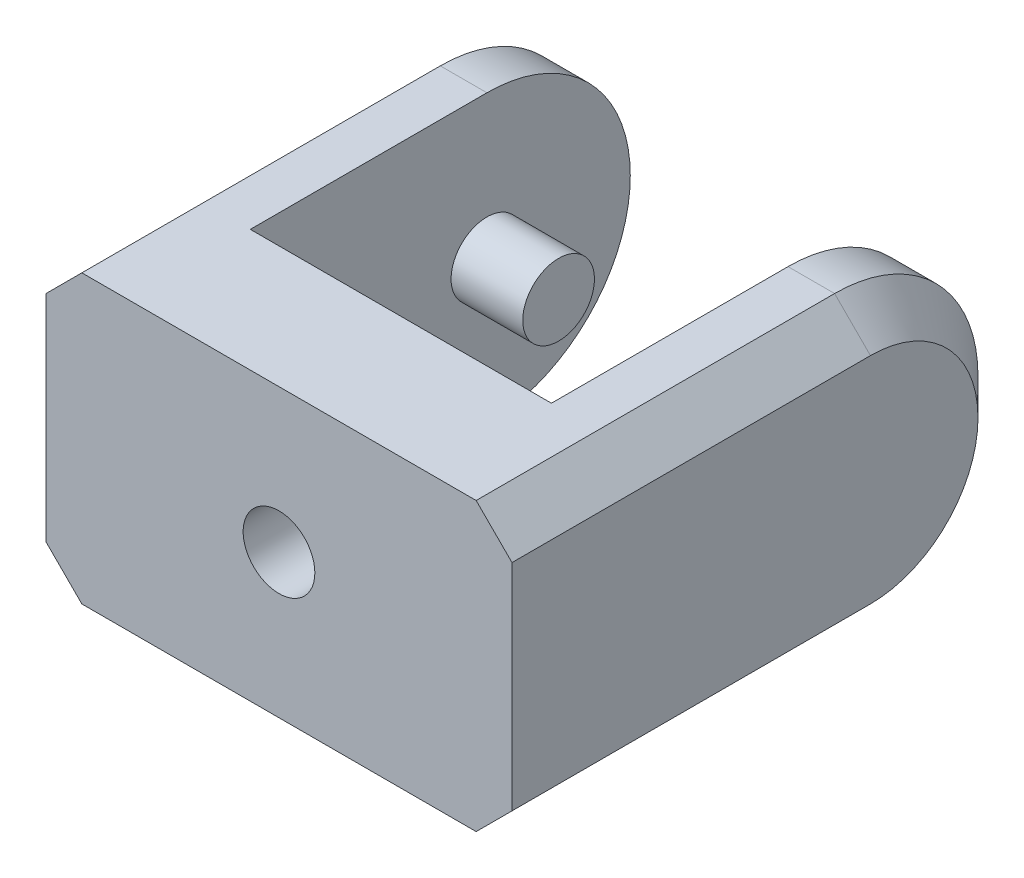
ISO-10303-21;
HEADER;
FILE_DESCRIPTION(('STEP AP214'),'2;1');
FILE_NAME('part.step','',(''),(''),'','','');
FILE_SCHEMA(('AUTOMOTIVE_DESIGN { 1 0 10303 214 1 1 1 1 }'));
ENDSEC;
DATA;
#1=APPLICATION_CONTEXT('core data for automotive mechanical design processes');
#2=APPLICATION_PROTOCOL_DEFINITION('international standard','automotive_design',2000,#1);
#3=PRODUCT_CONTEXT('',#1,'mechanical');
#4=PRODUCT('Part','Part','',(#3));
#5=PRODUCT_RELATED_PRODUCT_CATEGORY('part','',(#4));
#6=PRODUCT_DEFINITION_FORMATION('','',#4);
#7=PRODUCT_DEFINITION_CONTEXT('part definition',#1,'design');
#8=PRODUCT_DEFINITION('design','',#6,#7);
#9=PRODUCT_DEFINITION_SHAPE('','',#8);
#10=(LENGTH_UNIT() NAMED_UNIT(*) SI_UNIT(.MILLI.,.METRE.));
#11=(NAMED_UNIT(*) PLANE_ANGLE_UNIT() SI_UNIT($,.RADIAN.));
#12=(NAMED_UNIT(*) SI_UNIT($,.STERADIAN.) SOLID_ANGLE_UNIT());
#13=UNCERTAINTY_MEASURE_WITH_UNIT(LENGTH_MEASURE(1.E-05),#10,'distance_accuracy_value','');
#14=(GEOMETRIC_REPRESENTATION_CONTEXT(3) GLOBAL_UNCERTAINTY_ASSIGNED_CONTEXT((#13)) GLOBAL_UNIT_ASSIGNED_CONTEXT((#10,
#11,#12)) REPRESENTATION_CONTEXT('',''));
#15=CARTESIAN_POINT('',(0.,0.,0.));
#16=DIRECTION('',(0.,0.,1.));
#17=DIRECTION('',(1.,0.,0.));
#18=AXIS2_PLACEMENT_3D('',#15,#16,#17);
#19=CARTESIAN_POINT('',(0.,0.,0.));
#20=DIRECTION('',(0.,0.,-1.));
#21=DIRECTION('',(-1.,0.,0.));
#22=AXIS2_PLACEMENT_3D('',#19,#20,#21);
#23=PLANE('',#22);
#24=DIRECTION('',(1.,0.,0.));
#25=VECTOR('',#24,1.);
#26=CARTESIAN_POINT('',(0.,40.,0.));
#27=LINE('',#26,#25);
#28=CARTESIAN_POINT('',(11.5,40.,0.));
#29=VERTEX_POINT('',#28);
#30=CARTESIAN_POINT('',(53.5,40.,0.));
#31=VERTEX_POINT('',#30);
#32=EDGE_CURVE('E170',#29,#31,#27,.T.);
#33=ORIENTED_EDGE('',*,*,#32,.T.);
#34=DIRECTION('',(0.,1.,0.));
#35=VECTOR('',#34,1.);
#36=CARTESIAN_POINT('',(53.5,40.,0.));
#37=LINE('',#36,#35);
#38=CARTESIAN_POINT('',(53.5,0.,0.));
#39=VERTEX_POINT('',#38);
#40=EDGE_CURVE('E168',#39,#31,#37,.T.);
#41=ORIENTED_EDGE('',*,*,#40,.F.);
#42=DIRECTION('',(1.,0.,0.));
#43=VECTOR('',#42,1.);
#44=CARTESIAN_POINT('',(0.,0.,0.));
#45=LINE('',#44,#43);
#46=CARTESIAN_POINT('',(11.5,0.,0.));
#47=VERTEX_POINT('',#46);
#48=EDGE_CURVE('E153',#47,#39,#45,.T.);
#49=ORIENTED_EDGE('',*,*,#48,.F.);
#50=DIRECTION('',(0.,-1.,0.));
#51=VECTOR('',#50,1.);
#52=CARTESIAN_POINT('',(11.5,40.,0.));
#53=LINE('',#52,#51);
#54=EDGE_CURVE('E160',#29,#47,#53,.T.);
#55=ORIENTED_EDGE('',*,*,#54,.F.);
#56=EDGE_LOOP('',(#33,#41,#49,#55));
#57=FACE_BOUND('',#56,.T.);
#58=ADVANCED_FACE('F39',(#57),#23,.T.);
#59=CARTESIAN_POINT('',(0.,0.,17.));
#60=DIRECTION('',(-1.,0.,0.));
#61=DIRECTION('',(0.,-1.,0.));
#62=AXIS2_PLACEMENT_3D('',#59,#60,#61);
#63=PLANE('',#62);
#64=DIRECTION('',(0.,1.,0.));
#65=VECTOR('',#64,1.);
#66=CARTESIAN_POINT('',(0.,0.,17.));
#67=LINE('',#66,#65);
#68=CARTESIAN_POINT('',(0.,5.00000000000002,17.));
#69=VERTEX_POINT('',#68);
#70=CARTESIAN_POINT('',(0.,35.,17.));
#71=VERTEX_POINT('',#70);
#72=EDGE_CURVE('E169',#69,#71,#67,.T.);
#73=ORIENTED_EDGE('',*,*,#72,.T.);
#74=DIRECTION('',(0.,0.,-1.));
#75=VECTOR('',#74,1.);
#76=CARTESIAN_POINT('',(0.,35.,17.));
#77=LINE('',#76,#75);
#78=CARTESIAN_POINT('',(0.,35.,-33.));
#79=VERTEX_POINT('',#78);
#80=EDGE_CURVE('E223',#71,#79,#77,.T.);
#81=ORIENTED_EDGE('',*,*,#80,.T.);
#82=CARTESIAN_POINT('',(0.,20.,-33.));
#83=DIRECTION('',(-1.,0.,0.));
#84=DIRECTION('',(0.,-1.,0.));
#85=AXIS2_PLACEMENT_3D('',#82,#83,#84);
#86=CIRCLE('',#85,15.);
#87=CARTESIAN_POINT('',(0.,20.,-48.));
#88=VERTEX_POINT('',#87);
#89=EDGE_CURVE('E221',#79,#88,#86,.T.);
#90=ORIENTED_EDGE('',*,*,#89,.T.);
#91=CARTESIAN_POINT('',(0.,20.,-33.));
#92=DIRECTION('',(-1.,0.,0.));
#93=DIRECTION('',(0.,-1.,0.));
#94=AXIS2_PLACEMENT_3D('',#91,#92,#93);
#95=CIRCLE('',#94,15.);
#96=CARTESIAN_POINT('',(0.,5.00000000000002,-33.));
#97=VERTEX_POINT('',#96);
#98=EDGE_CURVE('E219',#88,#97,#95,.T.);
#99=ORIENTED_EDGE('',*,*,#98,.T.);
#100=DIRECTION('',(0.,0.,1.));
#101=VECTOR('',#100,1.);
#102=CARTESIAN_POINT('',(0.,5.00000000000002,17.));
#103=LINE('',#102,#101);
#104=EDGE_CURVE('E210',#97,#69,#103,.T.);
#105=ORIENTED_EDGE('',*,*,#104,.T.);
#106=EDGE_LOOP('',(#73,#81,#90,#99,#105));
#107=FACE_BOUND('',#106,.T.);
#108=ADVANCED_FACE('F355',(#107),#63,.T.);
#109=CARTESIAN_POINT('',(0.,0.,17.));
#110=DIRECTION('',(0.,1.,0.));
#111=DIRECTION('',(0.,0.,1.));
#112=AXIS2_PLACEMENT_3D('',#109,#110,#111);
#113=PLANE('',#112);
#114=DIRECTION('',(1.,0.,0.));
#115=VECTOR('',#114,1.);
#116=CARTESIAN_POINT('',(0.,0.,17.));
#117=LINE('',#116,#115);
#118=CARTESIAN_POINT('',(5.,0.,17.));
#119=VERTEX_POINT('',#118);
#120=CARTESIAN_POINT('',(60.,0.,17.));
#121=VERTEX_POINT('',#120);
#122=EDGE_CURVE('E188',#119,#121,#117,.T.);
#123=ORIENTED_EDGE('',*,*,#122,.F.);
#124=DIRECTION('',(0.,0.,-1.));
#125=VECTOR('',#124,1.);
#126=CARTESIAN_POINT('',(5.,0.,-33.));
#127=LINE('',#126,#125);
#128=CARTESIAN_POINT('',(5.,0.,-33.));
#129=VERTEX_POINT('',#128);
#130=EDGE_CURVE('E245',#119,#129,#127,.T.);
#131=ORIENTED_EDGE('',*,*,#130,.T.);
#132=DIRECTION('',(-1.,0.,0.));
#133=VECTOR('',#132,1.);
#134=CARTESIAN_POINT('',(0.,0.,-33.));
#135=LINE('',#134,#133);
#136=CARTESIAN_POINT('',(11.5,0.,-33.));
#137=VERTEX_POINT('',#136);
#138=EDGE_CURVE('E155',#129,#137,#135,.F.);
#139=ORIENTED_EDGE('',*,*,#138,.T.);
#140=DIRECTION('',(0.,0.,1.));
#141=VECTOR('',#140,1.);
#142=CARTESIAN_POINT('',(11.5,0.,-53.));
#143=LINE('',#142,#141);
#144=EDGE_CURVE('E148',#137,#47,#143,.T.);
#145=ORIENTED_EDGE('',*,*,#144,.T.);
#146=ORIENTED_EDGE('',*,*,#48,.T.);
#147=DIRECTION('',(0.,0.,1.));
#148=VECTOR('',#147,1.);
#149=CARTESIAN_POINT('',(53.5,0.,-53.));
#150=LINE('',#149,#148);
#151=CARTESIAN_POINT('',(53.5,0.,-33.));
#152=VERTEX_POINT('',#151);
#153=EDGE_CURVE('E213',#152,#39,#150,.T.);
#154=ORIENTED_EDGE('',*,*,#153,.F.);
#155=DIRECTION('',(-1.,0.,0.));
#156=VECTOR('',#155,1.);
#157=CARTESIAN_POINT('',(65.,0.,-33.));
#158=LINE('',#157,#156);
#159=CARTESIAN_POINT('',(60.,0.,-33.));
#160=VERTEX_POINT('',#159);
#161=EDGE_CURVE('E207',#152,#160,#158,.F.);
#162=ORIENTED_EDGE('',*,*,#161,.T.);
#163=DIRECTION('',(0.,0.,1.));
#164=VECTOR('',#163,1.);
#165=CARTESIAN_POINT('',(60.,0.,17.));
#166=LINE('',#165,#164);
#167=EDGE_CURVE('E243',#160,#121,#166,.T.);
#168=ORIENTED_EDGE('',*,*,#167,.T.);
#169=EDGE_LOOP('',(#123,#131,#139,#145,#146,#154,#162,#168));
#170=FACE_BOUND('',#169,.T.);
#171=ADVANCED_FACE('F151',(#170),#113,.F.);
#172=CARTESIAN_POINT('',(65.,0.,17.));
#173=DIRECTION('',(-1.,0.,0.));
#174=DIRECTION('',(0.,-1.,0.));
#175=AXIS2_PLACEMENT_3D('',#172,#173,#174);
#176=PLANE('',#175);
#177=CARTESIAN_POINT('',(65.,20.,-33.));
#178=DIRECTION('',(-1.,0.,0.));
#179=DIRECTION('',(0.,-1.,0.));
#180=AXIS2_PLACEMENT_3D('',#177,#178,#179);
#181=CIRCLE('',#180,15.);
#182=CARTESIAN_POINT('',(65.,20.,-48.));
#183=VERTEX_POINT('',#182);
#184=CARTESIAN_POINT('',(65.,35.,-33.));
#185=VERTEX_POINT('',#184);
#186=EDGE_CURVE('E63',#183,#185,#181,.F.);
#187=ORIENTED_EDGE('',*,*,#186,.T.);
#188=DIRECTION('',(0.,0.,1.));
#189=VECTOR('',#188,1.);
#190=CARTESIAN_POINT('',(65.,35.,17.));
#191=LINE('',#190,#189);
#192=CARTESIAN_POINT('',(65.,35.,17.));
#193=VERTEX_POINT('',#192);
#194=EDGE_CURVE('E252',#185,#193,#191,.T.);
#195=ORIENTED_EDGE('',*,*,#194,.T.);
#196=DIRECTION('',(0.,1.,0.));
#197=VECTOR('',#196,1.);
#198=CARTESIAN_POINT('',(65.,0.,17.));
#199=LINE('',#198,#197);
#200=CARTESIAN_POINT('',(65.,4.99999999999999,17.));
#201=VERTEX_POINT('',#200);
#202=EDGE_CURVE('E185',#201,#193,#199,.T.);
#203=ORIENTED_EDGE('',*,*,#202,.F.);
#204=DIRECTION('',(0.,0.,-1.));
#205=VECTOR('',#204,1.);
#206=CARTESIAN_POINT('',(65.,4.99999999999999,17.));
#207=LINE('',#206,#205);
#208=CARTESIAN_POINT('',(65.,4.99999999999999,-33.));
#209=VERTEX_POINT('',#208);
#210=EDGE_CURVE('E247',#201,#209,#207,.T.);
#211=ORIENTED_EDGE('',*,*,#210,.T.);
#212=CARTESIAN_POINT('',(65.,20.,-33.));
#213=DIRECTION('',(-1.,0.,0.));
#214=DIRECTION('',(0.,-1.,0.));
#215=AXIS2_PLACEMENT_3D('',#212,#213,#214);
#216=CIRCLE('',#215,15.);
#217=EDGE_CURVE('E249',#209,#183,#216,.F.);
#218=ORIENTED_EDGE('',*,*,#217,.T.);
#219=EDGE_LOOP('',(#187,#195,#203,#211,#218));
#220=FACE_BOUND('',#219,.T.);
#221=ADVANCED_FACE('F365',(#220),#176,.F.);
#222=CARTESIAN_POINT('',(0.,40.,17.));
#223=DIRECTION('',(0.,1.,0.));
#224=DIRECTION('',(0.,0.,1.));
#225=AXIS2_PLACEMENT_3D('',#222,#223,#224);
#226=PLANE('',#225);
#227=DIRECTION('',(1.,0.,0.));
#228=VECTOR('',#227,1.);
#229=CARTESIAN_POINT('',(0.,40.,-33.));
#230=LINE('',#229,#228);
#231=CARTESIAN_POINT('',(11.5,40.,-33.));
#232=VERTEX_POINT('',#231);
#233=CARTESIAN_POINT('',(5.,40.,-33.));
#234=VERTEX_POINT('',#233);
#235=EDGE_CURVE('E191',#232,#234,#230,.F.);
#236=ORIENTED_EDGE('',*,*,#235,.T.);
#237=DIRECTION('',(0.,0.,1.));
#238=VECTOR('',#237,1.);
#239=CARTESIAN_POINT('',(4.99999999999999,40.,17.));
#240=LINE('',#239,#238);
#241=CARTESIAN_POINT('',(4.99999999999999,40.,17.));
#242=VERTEX_POINT('',#241);
#243=EDGE_CURVE('E229',#234,#242,#240,.T.);
#244=ORIENTED_EDGE('',*,*,#243,.T.);
#245=DIRECTION('',(1.,0.,0.));
#246=VECTOR('',#245,1.);
#247=CARTESIAN_POINT('',(0.,40.,17.));
#248=LINE('',#247,#246);
#249=CARTESIAN_POINT('',(60.,40.,17.));
#250=VERTEX_POINT('',#249);
#251=EDGE_CURVE('E182',#242,#250,#248,.T.);
#252=ORIENTED_EDGE('',*,*,#251,.T.);
#253=DIRECTION('',(0.,0.,-1.));
#254=VECTOR('',#253,1.);
#255=CARTESIAN_POINT('',(60.,40.,-33.));
#256=LINE('',#255,#254);
#257=CARTESIAN_POINT('',(60.,40.,-33.));
#258=VERTEX_POINT('',#257);
#259=EDGE_CURVE('E226',#250,#258,#256,.T.);
#260=ORIENTED_EDGE('',*,*,#259,.T.);
#261=DIRECTION('',(1.,0.,0.));
#262=VECTOR('',#261,1.);
#263=CARTESIAN_POINT('',(0.,40.,-33.));
#264=LINE('',#263,#262);
#265=CARTESIAN_POINT('',(53.5,40.,-33.));
#266=VERTEX_POINT('',#265);
#267=EDGE_CURVE('E195',#258,#266,#264,.F.);
#268=ORIENTED_EDGE('',*,*,#267,.T.);
#269=DIRECTION('',(0.,0.,1.));
#270=VECTOR('',#269,1.);
#271=CARTESIAN_POINT('',(53.5,40.,-53.));
#272=LINE('',#271,#270);
#273=EDGE_CURVE('E175',#266,#31,#272,.T.);
#274=ORIENTED_EDGE('',*,*,#273,.T.);
#275=ORIENTED_EDGE('',*,*,#32,.F.);
#276=DIRECTION('',(0.,0.,1.));
#277=VECTOR('',#276,1.);
#278=CARTESIAN_POINT('',(11.5,40.,-53.));
#279=LINE('',#278,#277);
#280=EDGE_CURVE('E159',#232,#29,#279,.T.);
#281=ORIENTED_EDGE('',*,*,#280,.F.);
#282=EDGE_LOOP('',(#236,#244,#252,#260,#268,#274,#275,#281));
#283=FACE_BOUND('',#282,.T.);
#284=ADVANCED_FACE('F300',(#283),#226,.T.);
#285=CARTESIAN_POINT('',(0.,0.,17.));
#286=DIRECTION('',(0.,0.,-1.));
#287=DIRECTION('',(-1.,0.,0.));
#288=AXIS2_PLACEMENT_3D('',#285,#286,#287);
#289=PLANE('',#288);
#290=CARTESIAN_POINT('',(32.5,20.,17.));
#291=DIRECTION('',(0.,0.,1.));
#292=DIRECTION('',(1.,0.,0.));
#293=AXIS2_PLACEMENT_3D('',#290,#291,#292);
#294=CIRCLE('',#293,5.);
#295=CARTESIAN_POINT('',(37.5,20.,17.));
#296=VERTEX_POINT('',#295);
#297=EDGE_CURVE('E326',#296,#296,#294,.T.);
#298=ORIENTED_EDGE('',*,*,#297,.F.);
#299=EDGE_LOOP('',(#298));
#300=FACE_BOUND('',#299,.T.);
#301=ORIENTED_EDGE('',*,*,#251,.F.);
#302=DIRECTION('',(0.707106781186547,0.707106781186549,0.));
#303=VECTOR('',#302,1.);
#304=CARTESIAN_POINT('',(0.,35.,17.));
#305=LINE('',#304,#303);
#306=EDGE_CURVE('E237',#242,#71,#305,.F.);
#307=ORIENTED_EDGE('',*,*,#306,.T.);
#308=ORIENTED_EDGE('',*,*,#72,.F.);
#309=DIRECTION('',(0.707106781186547,-0.707106781186549,0.));
#310=VECTOR('',#309,1.);
#311=CARTESIAN_POINT('',(5.,0.,17.));
#312=LINE('',#311,#310);
#313=EDGE_CURVE('E235',#69,#119,#312,.T.);
#314=ORIENTED_EDGE('',*,*,#313,.T.);
#315=ORIENTED_EDGE('',*,*,#122,.T.);
#316=DIRECTION('',(-0.707106781186549,-0.707106781186546,0.));
#317=VECTOR('',#316,1.);
#318=CARTESIAN_POINT('',(65.,4.99999999999999,17.));
#319=LINE('',#318,#317);
#320=EDGE_CURVE('E231',#121,#201,#319,.F.);
#321=ORIENTED_EDGE('',*,*,#320,.T.);
#322=ORIENTED_EDGE('',*,*,#202,.T.);
#323=DIRECTION('',(-0.707106781186549,0.707106781186546,0.));
#324=VECTOR('',#323,1.);
#325=CARTESIAN_POINT('',(60.,40.,17.));
#326=LINE('',#325,#324);
#327=EDGE_CURVE('E233',#193,#250,#326,.T.);
#328=ORIENTED_EDGE('',*,*,#327,.T.);
#329=EDGE_LOOP('',(#301,#307,#308,#314,#315,#321,#322,#328));
#330=FACE_BOUND('',#329,.T.);
#331=ADVANCED_FACE('F284',(#300,#330),#289,.F.);
#332=CARTESIAN_POINT('',(11.5,40.,-53.));
#333=DIRECTION('',(-1.,0.,0.));
#334=DIRECTION('',(0.,-1.,0.));
#335=AXIS2_PLACEMENT_3D('',#332,#333,#334);
#336=PLANE('',#335);
#337=CARTESIAN_POINT('',(11.5,20.,-33.));
#338=DIRECTION('',(-1.,0.,0.));
#339=DIRECTION('',(0.,-1.,0.));
#340=AXIS2_PLACEMENT_3D('',#337,#338,#339);
#341=CIRCLE('',#340,5.);
#342=CARTESIAN_POINT('',(11.5,15.,-33.));
#343=VERTEX_POINT('',#342);
#344=EDGE_CURVE('E11',#343,#343,#341,.F.);
#345=ORIENTED_EDGE('',*,*,#344,.F.);
#346=EDGE_LOOP('',(#345));
#347=FACE_BOUND('',#346,.T.);
#348=CARTESIAN_POINT('',(11.5,20.,-33.));
#349=DIRECTION('',(-1.,0.,0.));
#350=DIRECTION('',(0.,-1.,0.));
#351=AXIS2_PLACEMENT_3D('',#348,#349,#350);
#352=CIRCLE('',#351,20.);
#353=CARTESIAN_POINT('',(11.5,20.,-53.));
#354=VERTEX_POINT('',#353);
#355=EDGE_CURVE('E202',#137,#354,#352,.F.);
#356=ORIENTED_EDGE('',*,*,#355,.T.);
#357=CARTESIAN_POINT('',(11.5,20.,-33.));
#358=DIRECTION('',(-1.,0.,0.));
#359=DIRECTION('',(0.,-1.,0.));
#360=AXIS2_PLACEMENT_3D('',#357,#358,#359);
#361=CIRCLE('',#360,20.);
#362=EDGE_CURVE('E204',#354,#232,#361,.F.);
#363=ORIENTED_EDGE('',*,*,#362,.T.);
#364=ORIENTED_EDGE('',*,*,#280,.T.);
#365=ORIENTED_EDGE('',*,*,#54,.T.);
#366=ORIENTED_EDGE('',*,*,#144,.F.);
#367=EDGE_LOOP('',(#356,#363,#364,#365,#366));
#368=FACE_BOUND('',#367,.T.);
#369=ADVANCED_FACE('F172',(#347,#368),#336,.F.);
#370=CARTESIAN_POINT('',(53.5,40.,-53.));
#371=DIRECTION('',(1.,0.,0.));
#372=DIRECTION('',(0.,1.,0.));
#373=AXIS2_PLACEMENT_3D('',#370,#371,#372);
#374=PLANE('',#373);
#375=ORIENTED_EDGE('',*,*,#273,.F.);
#376=CARTESIAN_POINT('',(53.5,20.,-33.));
#377=DIRECTION('',(1.,0.,0.));
#378=DIRECTION('',(0.,1.,0.));
#379=AXIS2_PLACEMENT_3D('',#376,#377,#378);
#380=CIRCLE('',#379,20.);
#381=CARTESIAN_POINT('',(53.5,20.,-53.));
#382=VERTEX_POINT('',#381);
#383=EDGE_CURVE('E199',#266,#382,#380,.F.);
#384=ORIENTED_EDGE('',*,*,#383,.T.);
#385=CARTESIAN_POINT('',(53.5,20.,-33.));
#386=DIRECTION('',(1.,0.,0.));
#387=DIRECTION('',(0.,1.,0.));
#388=AXIS2_PLACEMENT_3D('',#385,#386,#387);
#389=CIRCLE('',#388,20.);
#390=EDGE_CURVE('E197',#382,#152,#389,.F.);
#391=ORIENTED_EDGE('',*,*,#390,.T.);
#392=ORIENTED_EDGE('',*,*,#153,.T.);
#393=ORIENTED_EDGE('',*,*,#40,.T.);
#394=EDGE_LOOP('',(#375,#384,#391,#392,#393));
#395=FACE_BOUND('',#394,.T.);
#396=ADVANCED_FACE('F323',(#395),#374,.F.);
#397=CARTESIAN_POINT('',(0.,20.,-33.));
#398=DIRECTION('',(1.,0.,0.));
#399=DIRECTION('',(0.,0.,-1.));
#400=AXIS2_PLACEMENT_3D('',#397,#398,#399);
#401=CYLINDRICAL_SURFACE('',#400,20.);
#402=DIRECTION('',(-1.,0.,0.));
#403=VECTOR('',#402,1.);
#404=CARTESIAN_POINT('',(53.5,20.,-53.));
#405=LINE('',#404,#403);
#406=CARTESIAN_POINT('',(60.,20.,-53.));
#407=VERTEX_POINT('',#406);
#408=EDGE_CURVE('E211',#407,#382,#405,.T.);
#409=ORIENTED_EDGE('',*,*,#408,.F.);
#410=CARTESIAN_POINT('',(60.,20.,-33.));
#411=DIRECTION('',(-1.,0.,0.));
#412=DIRECTION('',(0.,0.,1.));
#413=AXIS2_PLACEMENT_3D('',#410,#411,#412);
#414=CIRCLE('',#413,20.);
#415=EDGE_CURVE('E48',#407,#160,#414,.T.);
#416=ORIENTED_EDGE('',*,*,#415,.T.);
#417=ORIENTED_EDGE('',*,*,#161,.F.);
#418=ORIENTED_EDGE('',*,*,#390,.F.);
#419=EDGE_LOOP('',(#409,#416,#417,#418));
#420=FACE_BOUND('',#419,.T.);
#421=ADVANCED_FACE('F350',(#420),#401,.T.);
#422=CARTESIAN_POINT('',(0.,20.,-33.));
#423=DIRECTION('',(1.,0.,0.));
#424=DIRECTION('',(0.,0.,-1.));
#425=AXIS2_PLACEMENT_3D('',#422,#423,#424);
#426=CYLINDRICAL_SURFACE('',#425,20.);
#427=ORIENTED_EDGE('',*,*,#267,.F.);
#428=CARTESIAN_POINT('',(60.,20.,-33.));
#429=DIRECTION('',(-1.,0.,0.));
#430=DIRECTION('',(0.,0.,1.));
#431=AXIS2_PLACEMENT_3D('',#428,#429,#430);
#432=CIRCLE('',#431,20.);
#433=EDGE_CURVE('E55',#258,#407,#432,.T.);
#434=ORIENTED_EDGE('',*,*,#433,.T.);
#435=ORIENTED_EDGE('',*,*,#408,.T.);
#436=ORIENTED_EDGE('',*,*,#383,.F.);
#437=EDGE_LOOP('',(#427,#434,#435,#436));
#438=FACE_BOUND('',#437,.T.);
#439=ADVANCED_FACE('F319',(#438),#426,.T.);
#440=CARTESIAN_POINT('',(0.,20.,-33.));
#441=DIRECTION('',(-1.,0.,0.));
#442=DIRECTION('',(0.,0.,1.));
#443=AXIS2_PLACEMENT_3D('',#440,#441,#442);
#444=CYLINDRICAL_SURFACE('',#443,20.);
#445=ORIENTED_EDGE('',*,*,#138,.F.);
#446=CARTESIAN_POINT('',(5.,20.,-33.));
#447=DIRECTION('',(-1.,0.,0.));
#448=DIRECTION('',(0.,0.,1.));
#449=AXIS2_PLACEMENT_3D('',#446,#447,#448);
#450=CIRCLE('',#449,20.);
#451=CARTESIAN_POINT('',(5.,20.,-53.));
#452=VERTEX_POINT('',#451);
#453=EDGE_CURVE('E241',#129,#452,#450,.F.);
#454=ORIENTED_EDGE('',*,*,#453,.T.);
#455=DIRECTION('',(-1.,0.,0.));
#456=VECTOR('',#455,1.);
#457=CARTESIAN_POINT('',(0.,20.,-53.));
#458=LINE('',#457,#456);
#459=EDGE_CURVE('E214',#354,#452,#458,.T.);
#460=ORIENTED_EDGE('',*,*,#459,.F.);
#461=ORIENTED_EDGE('',*,*,#355,.F.);
#462=EDGE_LOOP('',(#445,#454,#460,#461));
#463=FACE_BOUND('',#462,.T.);
#464=ADVANCED_FACE('F294',(#463),#444,.T.);
#465=CARTESIAN_POINT('',(0.,20.,-33.));
#466=DIRECTION('',(-1.,0.,0.));
#467=DIRECTION('',(0.,0.,1.));
#468=AXIS2_PLACEMENT_3D('',#465,#466,#467);
#469=CYLINDRICAL_SURFACE('',#468,20.);
#470=ORIENTED_EDGE('',*,*,#459,.T.);
#471=CARTESIAN_POINT('',(5.,20.,-33.));
#472=DIRECTION('',(-1.,0.,0.));
#473=DIRECTION('',(0.,0.,1.));
#474=AXIS2_PLACEMENT_3D('',#471,#472,#473);
#475=CIRCLE('',#474,20.);
#476=EDGE_CURVE('E239',#452,#234,#475,.F.);
#477=ORIENTED_EDGE('',*,*,#476,.T.);
#478=ORIENTED_EDGE('',*,*,#235,.F.);
#479=ORIENTED_EDGE('',*,*,#362,.F.);
#480=EDGE_LOOP('',(#470,#477,#478,#479));
#481=FACE_BOUND('',#480,.T.);
#482=ADVANCED_FACE('F302',(#481),#469,.T.);
#483=CARTESIAN_POINT('',(5.,0.,17.));
#484=DIRECTION('',(-0.707106781186549,-0.707106781186547,0.));
#485=DIRECTION('',(0.,0.,1.));
#486=AXIS2_PLACEMENT_3D('',#483,#484,#485);
#487=PLANE('',#486);
#488=ORIENTED_EDGE('',*,*,#313,.F.);
#489=ORIENTED_EDGE('',*,*,#104,.F.);
#490=DIRECTION('',(-0.707106781186547,0.707106781186549,0.));
#491=VECTOR('',#490,1.);
#492=CARTESIAN_POINT('',(5.,0.,-33.));
#493=LINE('',#492,#491);
#494=EDGE_CURVE('E217',#129,#97,#493,.T.);
#495=ORIENTED_EDGE('',*,*,#494,.F.);
#496=ORIENTED_EDGE('',*,*,#130,.F.);
#497=EDGE_LOOP('',(#488,#489,#495,#496));
#498=FACE_BOUND('',#497,.T.);
#499=ADVANCED_FACE('F290',(#498),#487,.T.);
#500=CARTESIAN_POINT('',(0.,20.,-33.));
#501=DIRECTION('',(1.,0.,0.));
#502=DIRECTION('',(0.,0.,-1.));
#503=AXIS2_PLACEMENT_3D('',#500,#501,#502);
#504=CONICAL_SURFACE('',#503,15.,0.78539816339745);
#505=ORIENTED_EDGE('',*,*,#494,.T.);
#506=ORIENTED_EDGE('',*,*,#98,.F.);
#507=DIRECTION('',(-0.707106781186547,0.,0.707106781186549));
#508=VECTOR('',#507,1.);
#509=CARTESIAN_POINT('',(5.,20.,-53.));
#510=LINE('',#509,#508);
#511=EDGE_CURVE('E258',#452,#88,#510,.T.);
#512=ORIENTED_EDGE('',*,*,#511,.F.);
#513=ORIENTED_EDGE('',*,*,#453,.F.);
#514=EDGE_LOOP('',(#505,#506,#512,#513));
#515=FACE_BOUND('',#514,.T.);
#516=ADVANCED_FACE('F390',(#515),#504,.T.);
#517=CARTESIAN_POINT('',(0.,20.,-33.));
#518=DIRECTION('',(1.,0.,0.));
#519=DIRECTION('',(0.,0.,-1.));
#520=AXIS2_PLACEMENT_3D('',#517,#518,#519);
#521=CONICAL_SURFACE('',#520,15.,0.78539816339745);
#522=ORIENTED_EDGE('',*,*,#511,.T.);
#523=ORIENTED_EDGE('',*,*,#89,.F.);
#524=DIRECTION('',(-0.707106781186547,-0.707106781186548,0.));
#525=VECTOR('',#524,1.);
#526=CARTESIAN_POINT('',(5.,40.,-33.));
#527=LINE('',#526,#525);
#528=EDGE_CURVE('E256',#234,#79,#527,.T.);
#529=ORIENTED_EDGE('',*,*,#528,.F.);
#530=ORIENTED_EDGE('',*,*,#476,.F.);
#531=EDGE_LOOP('',(#522,#523,#529,#530));
#532=FACE_BOUND('',#531,.T.);
#533=ADVANCED_FACE('F307',(#532),#521,.T.);
#534=CARTESIAN_POINT('',(0.,35.,17.));
#535=DIRECTION('',(0.707106781186549,-0.707106781186547,0.));
#536=DIRECTION('',(0.,0.,-1.));
#537=AXIS2_PLACEMENT_3D('',#534,#535,#536);
#538=PLANE('',#537);
#539=ORIENTED_EDGE('',*,*,#306,.F.);
#540=ORIENTED_EDGE('',*,*,#243,.F.);
#541=ORIENTED_EDGE('',*,*,#528,.T.);
#542=ORIENTED_EDGE('',*,*,#80,.F.);
#543=EDGE_LOOP('',(#539,#540,#541,#542));
#544=FACE_BOUND('',#543,.T.);
#545=ADVANCED_FACE('F312',(#544),#538,.F.);
#546=CARTESIAN_POINT('',(65.,4.99999999999999,17.));
#547=DIRECTION('',(-0.707106781186546,0.707106781186549,0.));
#548=DIRECTION('',(0.,0.,-1.));
#549=AXIS2_PLACEMENT_3D('',#546,#547,#548);
#550=PLANE('',#549);
#551=ORIENTED_EDGE('',*,*,#320,.F.);
#552=ORIENTED_EDGE('',*,*,#167,.F.);
#553=DIRECTION('',(-0.707106781186549,-0.707106781186546,0.));
#554=VECTOR('',#553,1.);
#555=CARTESIAN_POINT('',(65.,4.99999999999999,-33.));
#556=LINE('',#555,#554);
#557=EDGE_CURVE('E259',#209,#160,#556,.T.);
#558=ORIENTED_EDGE('',*,*,#557,.F.);
#559=ORIENTED_EDGE('',*,*,#210,.F.);
#560=EDGE_LOOP('',(#551,#552,#558,#559));
#561=FACE_BOUND('',#560,.T.);
#562=ADVANCED_FACE('F42',(#561),#550,.F.);
#563=CARTESIAN_POINT('',(65.,20.,-33.));
#564=DIRECTION('',(-1.,0.,0.));
#565=DIRECTION('',(0.,0.,1.));
#566=AXIS2_PLACEMENT_3D('',#563,#564,#565);
#567=CONICAL_SURFACE('',#566,15.,0.785398163397445);
#568=ORIENTED_EDGE('',*,*,#557,.T.);
#569=ORIENTED_EDGE('',*,*,#415,.F.);
#570=DIRECTION('',(-0.707106781186549,0.,-0.707106781186546));
#571=VECTOR('',#570,1.);
#572=CARTESIAN_POINT('',(65.,20.,-48.));
#573=LINE('',#572,#571);
#574=EDGE_CURVE('E266',#183,#407,#573,.T.);
#575=ORIENTED_EDGE('',*,*,#574,.F.);
#576=ORIENTED_EDGE('',*,*,#217,.F.);
#577=EDGE_LOOP('',(#568,#569,#575,#576));
#578=FACE_BOUND('',#577,.T.);
#579=ADVANCED_FACE('F274',(#578),#567,.T.);
#580=CARTESIAN_POINT('',(65.,20.,-33.));
#581=DIRECTION('',(-1.,0.,0.));
#582=DIRECTION('',(0.,0.,1.));
#583=AXIS2_PLACEMENT_3D('',#580,#581,#582);
#584=CONICAL_SURFACE('',#583,15.,0.785398163397446);
#585=ORIENTED_EDGE('',*,*,#574,.T.);
#586=ORIENTED_EDGE('',*,*,#433,.F.);
#587=DIRECTION('',(-0.707106781186549,0.707106781186546,0.));
#588=VECTOR('',#587,1.);
#589=CARTESIAN_POINT('',(65.,35.,-33.));
#590=LINE('',#589,#588);
#591=EDGE_CURVE('E264',#185,#258,#590,.T.);
#592=ORIENTED_EDGE('',*,*,#591,.F.);
#593=ORIENTED_EDGE('',*,*,#186,.F.);
#594=EDGE_LOOP('',(#585,#586,#592,#593));
#595=FACE_BOUND('',#594,.T.);
#596=ADVANCED_FACE('F408',(#595),#584,.T.);
#597=CARTESIAN_POINT('',(60.,40.,17.));
#598=DIRECTION('',(0.707106781186546,0.707106781186549,0.));
#599=DIRECTION('',(0.,0.,1.));
#600=AXIS2_PLACEMENT_3D('',#597,#598,#599);
#601=PLANE('',#600);
#602=ORIENTED_EDGE('',*,*,#327,.F.);
#603=ORIENTED_EDGE('',*,*,#194,.F.);
#604=ORIENTED_EDGE('',*,*,#591,.T.);
#605=ORIENTED_EDGE('',*,*,#259,.F.);
#606=EDGE_LOOP('',(#602,#603,#604,#605));
#607=FACE_BOUND('',#606,.T.);
#608=ADVANCED_FACE('F316',(#607),#601,.T.);
#609=CARTESIAN_POINT('',(32.5,20.,7.));
#610=DIRECTION('',(0.,0.,1.));
#611=DIRECTION('',(1.,0.,0.));
#612=AXIS2_PLACEMENT_3D('',#609,#610,#611);
#613=CYLINDRICAL_SURFACE('',#612,5.);
#614=CARTESIAN_POINT('',(32.5,20.,7.));
#615=DIRECTION('',(0.,0.,1.));
#616=DIRECTION('',(1.,0.,0.));
#617=AXIS2_PLACEMENT_3D('',#614,#615,#616);
#618=CIRCLE('',#617,5.);
#619=CARTESIAN_POINT('',(37.5,20.,7.));
#620=VERTEX_POINT('',#619);
#621=EDGE_CURVE('E267',#620,#620,#618,.T.);
#622=ORIENTED_EDGE('',*,*,#621,.F.);
#623=EDGE_LOOP('',(#622));
#624=FACE_BOUND('',#623,.T.);
#625=ORIENTED_EDGE('',*,*,#297,.T.);
#626=EDGE_LOOP('',(#625));
#627=FACE_BOUND('',#626,.T.);
#628=ADVANCED_FACE('F407',(#624,#627),#613,.F.);
#629=CARTESIAN_POINT('',(32.5,20.,7.));
#630=DIRECTION('',(0.,0.,1.));
#631=DIRECTION('',(1.,0.,0.));
#632=AXIS2_PLACEMENT_3D('',#629,#630,#631);
#633=PLANE('',#632);
#634=ORIENTED_EDGE('',*,*,#621,.T.);
#635=EDGE_LOOP('',(#634));
#636=FACE_BOUND('',#635,.T.);
#637=ADVANCED_FACE('F340',(#636),#633,.T.);
#638=CARTESIAN_POINT('',(21.5,20.,-33.));
#639=DIRECTION('',(-1.,0.,0.));
#640=DIRECTION('',(0.,-1.,0.));
#641=AXIS2_PLACEMENT_3D('',#638,#639,#640);
#642=CYLINDRICAL_SURFACE('',#641,5.);
#643=CARTESIAN_POINT('',(21.5,20.,-33.));
#644=DIRECTION('',(1.,0.,0.));
#645=DIRECTION('',(0.,1.,0.));
#646=AXIS2_PLACEMENT_3D('',#643,#644,#645);
#647=CIRCLE('',#646,5.);
#648=CARTESIAN_POINT('',(21.5,25.,-33.));
#649=VERTEX_POINT('',#648);
#650=EDGE_CURVE('E329',#649,#649,#647,.T.);
#651=ORIENTED_EDGE('',*,*,#650,.F.);
#652=EDGE_LOOP('',(#651));
#653=FACE_BOUND('',#652,.T.);
#654=ORIENTED_EDGE('',*,*,#344,.T.);
#655=EDGE_LOOP('',(#654));
#656=FACE_BOUND('',#655,.T.);
#657=ADVANCED_FACE('F337',(#653,#656),#642,.T.);
#658=CARTESIAN_POINT('',(21.5,20.,-33.));
#659=DIRECTION('',(1.,0.,0.));
#660=DIRECTION('',(0.,1.,0.));
#661=AXIS2_PLACEMENT_3D('',#658,#659,#660);
#662=PLANE('',#661);
#663=ORIENTED_EDGE('',*,*,#650,.T.);
#664=EDGE_LOOP('',(#663));
#665=FACE_BOUND('',#664,.T.);
#666=ADVANCED_FACE('F335',(#665),#662,.T.);
#667=CLOSED_SHELL('',(#58,#108,#171,#221,#284,#331,#369,#396,#421,#439,#464,#482,#499,#516,#533,
#545,#562,#579,#596,#608,#628,#637,#657,#666));
#668=MANIFOLD_SOLID_BREP('B2',#667);
#669=ADVANCED_BREP_SHAPE_REPRESENTATION('',(#18,#668),#14);
#670=SHAPE_DEFINITION_REPRESENTATION(#9,#669);
ENDSEC;
END-ISO-10303-21;
